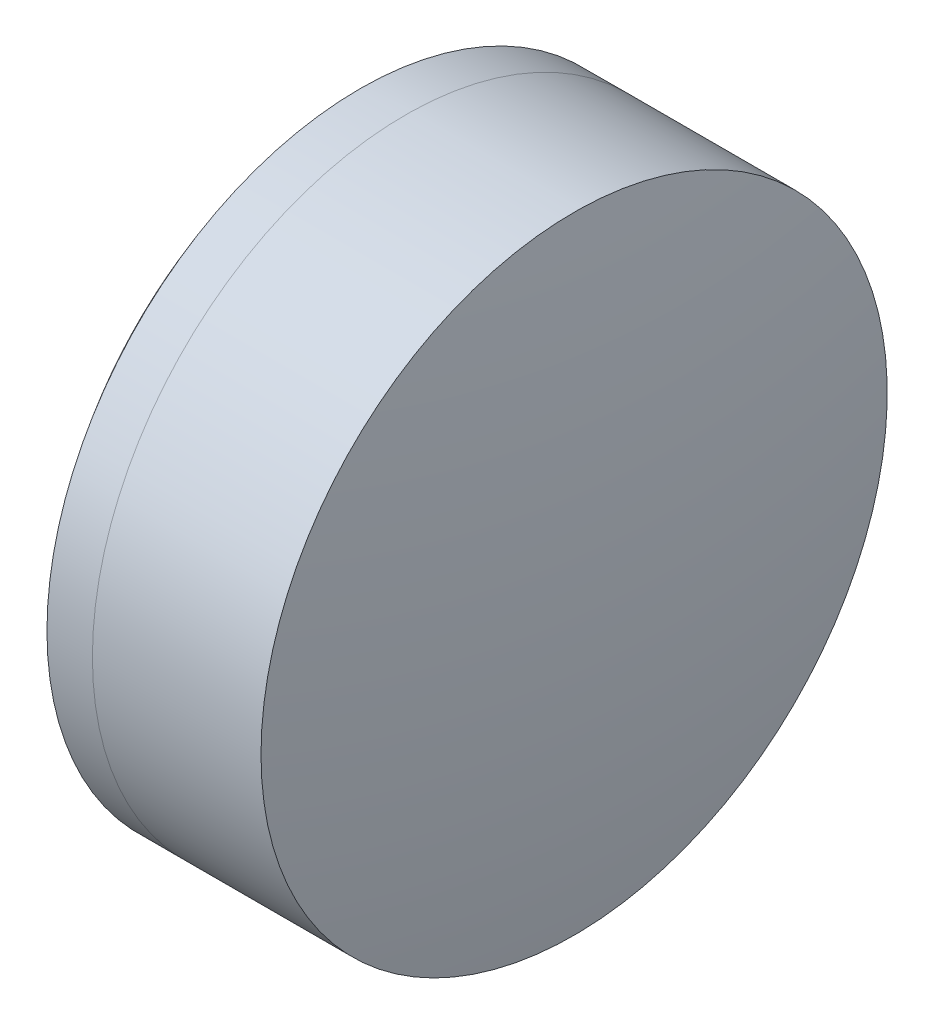
ISO-10303-21;
HEADER;
FILE_DESCRIPTION(('STEP AP214'),'2;1');
FILE_NAME('part.step','',(''),(''),'','','');
FILE_SCHEMA(('AUTOMOTIVE_DESIGN { 1 0 10303 214 1 1 1 1 }'));
ENDSEC;
DATA;
#1=APPLICATION_CONTEXT('core data for automotive mechanical design processes');
#2=APPLICATION_PROTOCOL_DEFINITION('international standard','automotive_design',2000,#1);
#3=PRODUCT_CONTEXT('',#1,'mechanical');
#4=PRODUCT('Part','Part','',(#3));
#5=PRODUCT_RELATED_PRODUCT_CATEGORY('part','',(#4));
#6=PRODUCT_DEFINITION_FORMATION('','',#4);
#7=PRODUCT_DEFINITION_CONTEXT('part definition',#1,'design');
#8=PRODUCT_DEFINITION('design','',#6,#7);
#9=PRODUCT_DEFINITION_SHAPE('','',#8);
#10=(LENGTH_UNIT() NAMED_UNIT(*) SI_UNIT(.MILLI.,.METRE.));
#11=(NAMED_UNIT(*) PLANE_ANGLE_UNIT() SI_UNIT($,.RADIAN.));
#12=(NAMED_UNIT(*) SI_UNIT($,.STERADIAN.) SOLID_ANGLE_UNIT());
#13=UNCERTAINTY_MEASURE_WITH_UNIT(LENGTH_MEASURE(1.E-05),#10,'distance_accuracy_value','');
#14=(GEOMETRIC_REPRESENTATION_CONTEXT(3) GLOBAL_UNCERTAINTY_ASSIGNED_CONTEXT((#13)) GLOBAL_UNIT_ASSIGNED_CONTEXT((#10,
#11,#12)) REPRESENTATION_CONTEXT('',''));
#15=CARTESIAN_POINT('',(0.,0.,0.));
#16=DIRECTION('',(0.,0.,1.));
#17=DIRECTION('',(1.,0.,0.));
#18=AXIS2_PLACEMENT_3D('',#15,#16,#17);
#19=CARTESIAN_POINT('',(210.539669764288,0.,0.));
#20=DIRECTION('',(-1.,0.,0.));
#21=DIRECTION('',(0.,0.,1.));
#22=AXIS2_PLACEMENT_3D('',#19,#20,#21);
#23=SPHERICAL_SURFACE('',#22,16.7);
#24=CARTESIAN_POINT('',(221.384023133669,0.,0.));
#25=DIRECTION('',(-1.,0.,0.));
#26=DIRECTION('',(0.,0.,1.));
#27=AXIS2_PLACEMENT_3D('',#24,#25,#26);
#28=CIRCLE('',#27,12.7);
#29=CARTESIAN_POINT('',(221.384023133669,0.,12.7));
#30=VERTEX_POINT('',#29);
#31=EDGE_CURVE('E11',#30,#30,#28,.T.);
#32=ORIENTED_EDGE('',*,*,#31,.T.);
#33=EDGE_LOOP('',(#32));
#34=FACE_BOUND('',#33,.T.);
#35=ADVANCED_FACE('F53',(#34),#23,.F.);
#36=CARTESIAN_POINT('',(-0.551919992657797,0.,0.));
#37=DIRECTION('',(-1.,0.,0.));
#38=DIRECTION('',(0.,0.,1.));
#39=AXIS2_PLACEMENT_3D('',#36,#37,#38);
#40=CYLINDRICAL_SURFACE('',#39,12.7);
#41=CARTESIAN_POINT('',(228.222599387399,0.,0.));
#42=DIRECTION('',(-1.,0.,0.));
#43=DIRECTION('',(0.,0.,1.));
#44=AXIS2_PLACEMENT_3D('',#41,#42,#43);
#45=CIRCLE('',#44,12.7);
#46=CARTESIAN_POINT('',(228.222599387399,0.,12.7));
#47=VERTEX_POINT('',#46);
#48=EDGE_CURVE('E60',#47,#47,#45,.T.);
#49=ORIENTED_EDGE('',*,*,#48,.T.);
#50=EDGE_LOOP('',(#49));
#51=FACE_BOUND('',#50,.T.);
#52=ORIENTED_EDGE('',*,*,#31,.F.);
#53=EDGE_LOOP('',(#52));
#54=FACE_BOUND('',#53,.T.);
#55=ADVANCED_FACE('F67',(#51,#54),#40,.T.);
#56=CARTESIAN_POINT('',(149.439669764288,0.,0.));
#57=DIRECTION('',(-1.,0.,0.));
#58=DIRECTION('',(0.,0.,1.));
#59=AXIS2_PLACEMENT_3D('',#56,#57,#58);
#60=SPHERICAL_SURFACE('',#59,79.8);
#61=ORIENTED_EDGE('',*,*,#48,.F.);
#62=EDGE_LOOP('',(#61));
#63=FACE_BOUND('',#62,.T.);
#64=ADVANCED_FACE('F70',(#63),#60,.T.);
#65=CLOSED_SHELL('',(#35,#55,#64));
#66=MANIFOLD_SOLID_BREP('B2',#65);
#67=CARTESIAN_POINT('',(236.139669764288,0.,0.));
#68=DIRECTION('',(-1.,0.,0.));
#69=DIRECTION('',(0.,0.,-1.));
#70=AXIS2_PLACEMENT_3D('',#67,#68,#69);
#71=SPHERICAL_SURFACE('',#70,20.9);
#72=CARTESIAN_POINT('',(219.540874627291,0.,0.));
#73=DIRECTION('',(-1.,0.,0.));
#74=DIRECTION('',(0.,0.,1.));
#75=AXIS2_PLACEMENT_3D('',#72,#73,#74);
#76=CIRCLE('',#75,12.7);
#77=CARTESIAN_POINT('',(219.540874627291,0.,12.7));
#78=VERTEX_POINT('',#77);
#79=EDGE_CURVE('E52',#78,#78,#76,.T.);
#80=ORIENTED_EDGE('',*,*,#79,.T.);
#81=EDGE_LOOP('',(#80));
#82=FACE_BOUND('',#81,.T.);
#83=ADVANCED_FACE('F101',(#82),#71,.T.);
#84=CARTESIAN_POINT('',(-9.70261217833668,0.,0.));
#85=DIRECTION('',(-1.,0.,0.));
#86=DIRECTION('',(0.,0.,1.));
#87=AXIS2_PLACEMENT_3D('',#84,#85,#86);
#88=CYLINDRICAL_SURFACE('',#87,12.7);
#89=CARTESIAN_POINT('',(221.384023133669,0.,0.));
#90=DIRECTION('',(-1.,0.,0.));
#91=DIRECTION('',(0.,0.,1.));
#92=AXIS2_PLACEMENT_3D('',#89,#90,#91);
#93=CIRCLE('',#92,12.7);
#94=CARTESIAN_POINT('',(221.384023133669,0.,12.7));
#95=VERTEX_POINT('',#94);
#96=EDGE_CURVE('E108',#95,#95,#93,.T.);
#97=ORIENTED_EDGE('',*,*,#96,.T.);
#98=EDGE_LOOP('',(#97));
#99=FACE_BOUND('',#98,.T.);
#100=ORIENTED_EDGE('',*,*,#79,.F.);
#101=EDGE_LOOP('',(#100));
#102=FACE_BOUND('',#101,.T.);
#103=ADVANCED_FACE('F115',(#99,#102),#88,.T.);
#104=CARTESIAN_POINT('',(210.539669764288,0.,0.));
#105=DIRECTION('',(-1.,0.,0.));
#106=DIRECTION('',(0.,0.,1.));
#107=AXIS2_PLACEMENT_3D('',#104,#105,#106);
#108=SPHERICAL_SURFACE('',#107,16.7);
#109=ORIENTED_EDGE('',*,*,#96,.F.);
#110=EDGE_LOOP('',(#109));
#111=FACE_BOUND('',#110,.T.);
#112=ADVANCED_FACE('F118',(#111),#108,.T.);
#113=CLOSED_SHELL('',(#83,#103,#112));
#114=MANIFOLD_SOLID_BREP('B6',#113);
#115=ADVANCED_BREP_SHAPE_REPRESENTATION('',(#18,#66,#114),#14);
#116=SHAPE_DEFINITION_REPRESENTATION(#9,#115);
ENDSEC;
END-ISO-10303-21;
